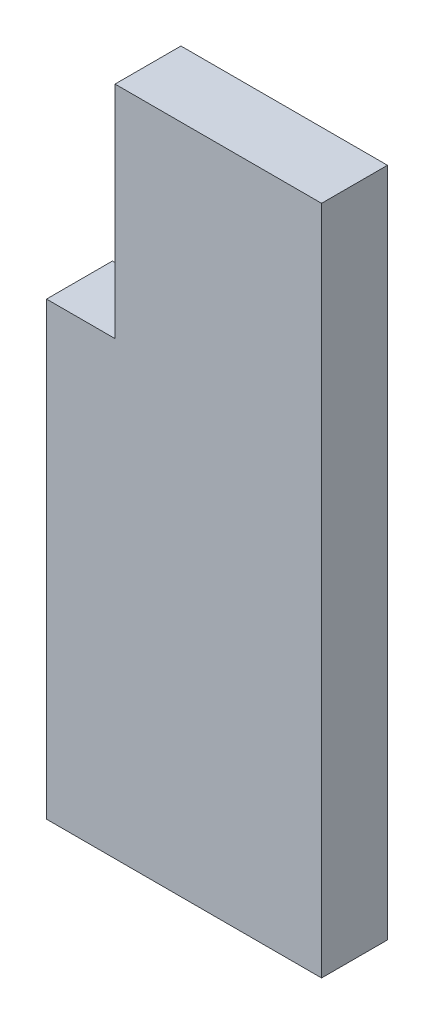
ISO-10303-21;
HEADER;
FILE_DESCRIPTION(('STEP AP214'),'2;1');
FILE_NAME('part.step','',(''),(''),'','','');
FILE_SCHEMA(('AUTOMOTIVE_DESIGN { 1 0 10303 214 1 1 1 1 }'));
ENDSEC;
DATA;
#1=APPLICATION_CONTEXT('core data for automotive mechanical design processes');
#2=APPLICATION_PROTOCOL_DEFINITION('international standard','automotive_design',2000,#1);
#3=PRODUCT_CONTEXT('',#1,'mechanical');
#4=PRODUCT('Part','Part','',(#3));
#5=PRODUCT_RELATED_PRODUCT_CATEGORY('part','',(#4));
#6=PRODUCT_DEFINITION_FORMATION('','',#4);
#7=PRODUCT_DEFINITION_CONTEXT('part definition',#1,'design');
#8=PRODUCT_DEFINITION('design','',#6,#7);
#9=PRODUCT_DEFINITION_SHAPE('','',#8);
#10=(LENGTH_UNIT() NAMED_UNIT(*) SI_UNIT(.MILLI.,.METRE.));
#11=(NAMED_UNIT(*) PLANE_ANGLE_UNIT() SI_UNIT($,.RADIAN.));
#12=(NAMED_UNIT(*) SI_UNIT($,.STERADIAN.) SOLID_ANGLE_UNIT());
#13=UNCERTAINTY_MEASURE_WITH_UNIT(LENGTH_MEASURE(1.E-05),#10,'distance_accuracy_value','');
#14=(GEOMETRIC_REPRESENTATION_CONTEXT(3) GLOBAL_UNCERTAINTY_ASSIGNED_CONTEXT((#13)) GLOBAL_UNIT_ASSIGNED_CONTEXT((#10,
#11,#12)) REPRESENTATION_CONTEXT('',''));
#15=CARTESIAN_POINT('',(0.,0.,0.));
#16=DIRECTION('',(0.,0.,1.));
#17=DIRECTION('',(1.,0.,0.));
#18=AXIS2_PLACEMENT_3D('',#15,#16,#17);
#19=CARTESIAN_POINT('',(13.25,0.,3.175));
#20=DIRECTION('',(1.,0.,0.));
#21=DIRECTION('',(0.,0.,-1.));
#22=AXIS2_PLACEMENT_3D('',#19,#20,#21);
#23=PLANE('',#22);
#24=DIRECTION('',(0.,-1.,0.));
#25=VECTOR('',#24,1.);
#26=CARTESIAN_POINT('',(13.25,0.,0.));
#27=LINE('',#26,#25);
#28=CARTESIAN_POINT('',(13.25,32.32,0.));
#29=VERTEX_POINT('',#28);
#30=CARTESIAN_POINT('',(13.25,0.,0.));
#31=VERTEX_POINT('',#30);
#32=EDGE_CURVE('E55',#29,#31,#27,.T.);
#33=ORIENTED_EDGE('',*,*,#32,.F.);
#34=DIRECTION('',(0.,0.,-1.));
#35=VECTOR('',#34,1.);
#36=CARTESIAN_POINT('',(13.25,32.32,3.175));
#37=LINE('',#36,#35);
#38=CARTESIAN_POINT('',(13.25,32.32,3.175));
#39=VERTEX_POINT('',#38);
#40=EDGE_CURVE('E11',#39,#29,#37,.T.);
#41=ORIENTED_EDGE('',*,*,#40,.F.);
#42=DIRECTION('',(0.,-1.,0.));
#43=VECTOR('',#42,1.);
#44=CARTESIAN_POINT('',(13.25,0.,3.175));
#45=LINE('',#44,#43);
#46=CARTESIAN_POINT('',(13.25,0.,3.175));
#47=VERTEX_POINT('',#46);
#48=EDGE_CURVE('E151',#39,#47,#45,.T.);
#49=ORIENTED_EDGE('',*,*,#48,.T.);
#50=DIRECTION('',(0.,0.,1.));
#51=VECTOR('',#50,1.);
#52=CARTESIAN_POINT('',(13.25,0.,-54.0722192997476));
#53=LINE('',#52,#51);
#54=EDGE_CURVE('E137',#31,#47,#53,.T.);
#55=ORIENTED_EDGE('',*,*,#54,.F.);
#56=EDGE_LOOP('',(#33,#41,#49,#55));
#57=FACE_BOUND('',#56,.T.);
#58=ADVANCED_FACE('F40',(#57),#23,.T.);
#59=CARTESIAN_POINT('',(0.,32.32,3.175));
#60=DIRECTION('',(0.,-1.,0.));
#61=DIRECTION('',(0.,0.,-1.));
#62=AXIS2_PLACEMENT_3D('',#59,#60,#61);
#63=PLANE('',#62);
#64=DIRECTION('',(-1.,0.,0.));
#65=VECTOR('',#64,1.);
#66=CARTESIAN_POINT('',(0.,32.32,0.));
#67=LINE('',#66,#65);
#68=CARTESIAN_POINT('',(3.3,32.32,0.));
#69=VERTEX_POINT('',#68);
#70=EDGE_CURVE('E136',#29,#69,#67,.T.);
#71=ORIENTED_EDGE('',*,*,#70,.T.);
#72=DIRECTION('',(0.,0.,-1.));
#73=VECTOR('',#72,1.);
#74=CARTESIAN_POINT('',(3.3,32.32,3.175));
#75=LINE('',#74,#73);
#76=CARTESIAN_POINT('',(3.3,32.32,3.175));
#77=VERTEX_POINT('',#76);
#78=EDGE_CURVE('E48',#77,#69,#75,.T.);
#79=ORIENTED_EDGE('',*,*,#78,.F.);
#80=DIRECTION('',(-1.,0.,0.));
#81=VECTOR('',#80,1.);
#82=CARTESIAN_POINT('',(0.,32.32,3.175));
#83=LINE('',#82,#81);
#84=EDGE_CURVE('E107',#39,#77,#83,.T.);
#85=ORIENTED_EDGE('',*,*,#84,.F.);
#86=ORIENTED_EDGE('',*,*,#40,.T.);
#87=EDGE_LOOP('',(#71,#79,#85,#86));
#88=FACE_BOUND('',#87,.T.);
#89=ADVANCED_FACE('F169',(#88),#63,.F.);
#90=CARTESIAN_POINT('',(3.3,0.,3.175));
#91=DIRECTION('',(1.,0.,0.));
#92=DIRECTION('',(0.,1.,0.));
#93=AXIS2_PLACEMENT_3D('',#90,#91,#92);
#94=PLANE('',#93);
#95=DIRECTION('',(0.,-1.,0.));
#96=VECTOR('',#95,1.);
#97=CARTESIAN_POINT('',(3.3,0.,0.));
#98=LINE('',#97,#96);
#99=CARTESIAN_POINT('',(3.3,21.7,0.));
#100=VERTEX_POINT('',#99);
#101=EDGE_CURVE('E117',#69,#100,#98,.T.);
#102=ORIENTED_EDGE('',*,*,#101,.T.);
#103=DIRECTION('',(0.,0.,-1.));
#104=VECTOR('',#103,1.);
#105=CARTESIAN_POINT('',(3.3,21.7,3.175));
#106=LINE('',#105,#104);
#107=CARTESIAN_POINT('',(3.3,21.7,3.175));
#108=VERTEX_POINT('',#107);
#109=EDGE_CURVE('E114',#108,#100,#106,.T.);
#110=ORIENTED_EDGE('',*,*,#109,.F.);
#111=DIRECTION('',(0.,-1.,0.));
#112=VECTOR('',#111,1.);
#113=CARTESIAN_POINT('',(3.3,0.,3.175));
#114=LINE('',#113,#112);
#115=EDGE_CURVE('E100',#77,#108,#114,.T.);
#116=ORIENTED_EDGE('',*,*,#115,.F.);
#117=ORIENTED_EDGE('',*,*,#78,.T.);
#118=EDGE_LOOP('',(#102,#110,#116,#117));
#119=FACE_BOUND('',#118,.T.);
#120=ADVANCED_FACE('F115',(#119),#94,.F.);
#121=CARTESIAN_POINT('',(0.,21.7,3.175));
#122=DIRECTION('',(0.,-1.,0.));
#123=DIRECTION('',(0.,0.,-1.));
#124=AXIS2_PLACEMENT_3D('',#121,#122,#123);
#125=PLANE('',#124);
#126=DIRECTION('',(-1.,0.,0.));
#127=VECTOR('',#126,1.);
#128=CARTESIAN_POINT('',(0.,21.7,0.));
#129=LINE('',#128,#127);
#130=CARTESIAN_POINT('',(0.,21.7,0.));
#131=VERTEX_POINT('',#130);
#132=EDGE_CURVE('E142',#100,#131,#129,.T.);
#133=ORIENTED_EDGE('',*,*,#132,.T.);
#134=DIRECTION('',(0.,0.,-1.));
#135=VECTOR('',#134,1.);
#136=CARTESIAN_POINT('',(0.,21.7,3.175));
#137=LINE('',#136,#135);
#138=CARTESIAN_POINT('',(0.,21.7,3.175));
#139=VERTEX_POINT('',#138);
#140=EDGE_CURVE('E121',#139,#131,#137,.T.);
#141=ORIENTED_EDGE('',*,*,#140,.F.);
#142=DIRECTION('',(-1.,0.,0.));
#143=VECTOR('',#142,1.);
#144=CARTESIAN_POINT('',(0.,21.7,3.175));
#145=LINE('',#144,#143);
#146=EDGE_CURVE('E104',#108,#139,#145,.T.);
#147=ORIENTED_EDGE('',*,*,#146,.F.);
#148=ORIENTED_EDGE('',*,*,#109,.T.);
#149=EDGE_LOOP('',(#133,#141,#147,#148));
#150=FACE_BOUND('',#149,.T.);
#151=ADVANCED_FACE('F123',(#150),#125,.F.);
#152=CARTESIAN_POINT('',(0.,0.,3.175));
#153=DIRECTION('',(1.,0.,0.));
#154=DIRECTION('',(0.,1.,0.));
#155=AXIS2_PLACEMENT_3D('',#152,#153,#154);
#156=PLANE('',#155);
#157=DIRECTION('',(0.,-1.,0.));
#158=VECTOR('',#157,1.);
#159=CARTESIAN_POINT('',(0.,0.,0.));
#160=LINE('',#159,#158);
#161=CARTESIAN_POINT('',(0.,0.,0.));
#162=VERTEX_POINT('',#161);
#163=EDGE_CURVE('E87',#131,#162,#160,.T.);
#164=ORIENTED_EDGE('',*,*,#163,.T.);
#165=DIRECTION('',(0.,0.,-1.));
#166=VECTOR('',#165,1.);
#167=CARTESIAN_POINT('',(0.,0.,3.175));
#168=LINE('',#167,#166);
#169=CARTESIAN_POINT('',(0.,0.,3.175));
#170=VERTEX_POINT('',#169);
#171=EDGE_CURVE('E133',#170,#162,#168,.T.);
#172=ORIENTED_EDGE('',*,*,#171,.F.);
#173=DIRECTION('',(0.,-1.,0.));
#174=VECTOR('',#173,1.);
#175=CARTESIAN_POINT('',(0.,0.,3.175));
#176=LINE('',#175,#174);
#177=EDGE_CURVE('E64',#139,#170,#176,.T.);
#178=ORIENTED_EDGE('',*,*,#177,.F.);
#179=ORIENTED_EDGE('',*,*,#140,.T.);
#180=EDGE_LOOP('',(#164,#172,#178,#179));
#181=FACE_BOUND('',#180,.T.);
#182=ADVANCED_FACE('F158',(#181),#156,.F.);
#183=CARTESIAN_POINT('',(0.,0.,3.175));
#184=DIRECTION('',(0.,1.,0.));
#185=DIRECTION('',(0.,0.,1.));
#186=AXIS2_PLACEMENT_3D('',#183,#184,#185);
#187=PLANE('',#186);
#188=DIRECTION('',(1.,0.,0.));
#189=VECTOR('',#188,1.);
#190=CARTESIAN_POINT('',(0.,0.,0.));
#191=LINE('',#190,#189);
#192=EDGE_CURVE('E147',#162,#31,#191,.T.);
#193=ORIENTED_EDGE('',*,*,#192,.T.);
#194=ORIENTED_EDGE('',*,*,#54,.T.);
#195=DIRECTION('',(1.,0.,0.));
#196=VECTOR('',#195,1.);
#197=CARTESIAN_POINT('',(0.,0.,3.175));
#198=LINE('',#197,#196);
#199=EDGE_CURVE('E127',#170,#47,#198,.T.);
#200=ORIENTED_EDGE('',*,*,#199,.F.);
#201=ORIENTED_EDGE('',*,*,#171,.T.);
#202=EDGE_LOOP('',(#193,#194,#200,#201));
#203=FACE_BOUND('',#202,.T.);
#204=ADVANCED_FACE('F162',(#203),#187,.F.);
#205=CARTESIAN_POINT('',(0.,0.,3.175));
#206=DIRECTION('',(0.,0.,1.));
#207=DIRECTION('',(1.,0.,0.));
#208=AXIS2_PLACEMENT_3D('',#205,#206,#207);
#209=PLANE('',#208);
#210=ORIENTED_EDGE('',*,*,#199,.T.);
#211=ORIENTED_EDGE('',*,*,#48,.F.);
#212=ORIENTED_EDGE('',*,*,#84,.T.);
#213=ORIENTED_EDGE('',*,*,#115,.T.);
#214=ORIENTED_EDGE('',*,*,#146,.T.);
#215=ORIENTED_EDGE('',*,*,#177,.T.);
#216=EDGE_LOOP('',(#210,#211,#212,#213,#214,#215));
#217=FACE_BOUND('',#216,.T.);
#218=ADVANCED_FACE('F102',(#217),#209,.T.);
#219=CARTESIAN_POINT('',(0.,0.,0.));
#220=DIRECTION('',(0.,0.,1.));
#221=DIRECTION('',(1.,0.,0.));
#222=AXIS2_PLACEMENT_3D('',#219,#220,#221);
#223=PLANE('',#222);
#224=ORIENTED_EDGE('',*,*,#32,.T.);
#225=ORIENTED_EDGE('',*,*,#192,.F.);
#226=ORIENTED_EDGE('',*,*,#163,.F.);
#227=ORIENTED_EDGE('',*,*,#132,.F.);
#228=ORIENTED_EDGE('',*,*,#101,.F.);
#229=ORIENTED_EDGE('',*,*,#70,.F.);
#230=EDGE_LOOP('',(#224,#225,#226,#227,#228,#229));
#231=FACE_BOUND('',#230,.T.);
#232=ADVANCED_FACE('F157',(#231),#223,.F.);
#233=CLOSED_SHELL('',(#58,#89,#120,#151,#182,#204,#218,#232));
#234=MANIFOLD_SOLID_BREP('B2',#233);
#235=ADVANCED_BREP_SHAPE_REPRESENTATION('',(#18,#234),#14);
#236=SHAPE_DEFINITION_REPRESENTATION(#9,#235);
ENDSEC;
END-ISO-10303-21;
